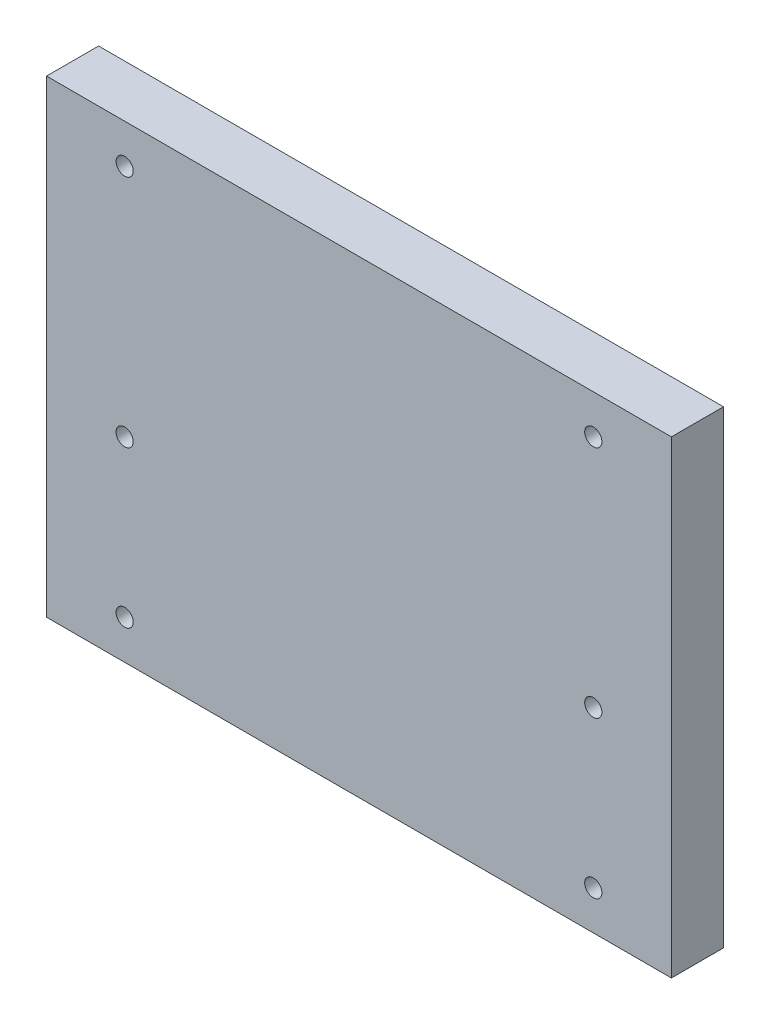
ISO-10303-21;
HEADER;
FILE_DESCRIPTION(('STEP AP214'),'2;1');
FILE_NAME('part.step','',(''),(''),'','','');
FILE_SCHEMA(('AUTOMOTIVE_DESIGN { 1 0 10303 214 1 1 1 1 }'));
ENDSEC;
DATA;
#1=APPLICATION_CONTEXT('core data for automotive mechanical design processes');
#2=APPLICATION_PROTOCOL_DEFINITION('international standard','automotive_design',2000,#1);
#3=PRODUCT_CONTEXT('',#1,'mechanical');
#4=PRODUCT('Part','Part','',(#3));
#5=PRODUCT_RELATED_PRODUCT_CATEGORY('part','',(#4));
#6=PRODUCT_DEFINITION_FORMATION('','',#4);
#7=PRODUCT_DEFINITION_CONTEXT('part definition',#1,'design');
#8=PRODUCT_DEFINITION('design','',#6,#7);
#9=PRODUCT_DEFINITION_SHAPE('','',#8);
#10=(LENGTH_UNIT() NAMED_UNIT(*) SI_UNIT(.MILLI.,.METRE.));
#11=(NAMED_UNIT(*) PLANE_ANGLE_UNIT() SI_UNIT($,.RADIAN.));
#12=(NAMED_UNIT(*) SI_UNIT($,.STERADIAN.) SOLID_ANGLE_UNIT());
#13=UNCERTAINTY_MEASURE_WITH_UNIT(LENGTH_MEASURE(1.E-05),#10,'distance_accuracy_value','');
#14=(GEOMETRIC_REPRESENTATION_CONTEXT(3) GLOBAL_UNCERTAINTY_ASSIGNED_CONTEXT((#13)) GLOBAL_UNIT_ASSIGNED_CONTEXT((#10,
#11,#12)) REPRESENTATION_CONTEXT('',''));
#15=CARTESIAN_POINT('',(0.,0.,0.));
#16=DIRECTION('',(0.,0.,1.));
#17=DIRECTION('',(1.,0.,0.));
#18=AXIS2_PLACEMENT_3D('',#15,#16,#17);
#19=CARTESIAN_POINT('',(120.,90.,20.));
#20=DIRECTION('',(-1.,0.,0.));
#21=DIRECTION('',(0.,-1.,0.));
#22=AXIS2_PLACEMENT_3D('',#19,#20,#21);
#23=PLANE('',#22);
#24=DIRECTION('',(0.,1.,0.));
#25=VECTOR('',#24,1.);
#26=CARTESIAN_POINT('',(120.,90.,0.));
#27=LINE('',#26,#25);
#28=CARTESIAN_POINT('',(120.,-90.,0.));
#29=VERTEX_POINT('',#28);
#30=CARTESIAN_POINT('',(120.,90.,0.));
#31=VERTEX_POINT('',#30);
#32=EDGE_CURVE('E100',#29,#31,#27,.T.);
#33=ORIENTED_EDGE('',*,*,#32,.T.);
#34=DIRECTION('',(0.,0.,-1.));
#35=VECTOR('',#34,1.);
#36=CARTESIAN_POINT('',(120.,90.,20.));
#37=LINE('',#36,#35);
#38=CARTESIAN_POINT('',(120.,90.,20.));
#39=VERTEX_POINT('',#38);
#40=EDGE_CURVE('E11',#39,#31,#37,.T.);
#41=ORIENTED_EDGE('',*,*,#40,.F.);
#42=DIRECTION('',(0.,1.,0.));
#43=VECTOR('',#42,1.);
#44=CARTESIAN_POINT('',(120.,90.,20.));
#45=LINE('',#44,#43);
#46=CARTESIAN_POINT('',(120.,-90.,20.));
#47=VERTEX_POINT('',#46);
#48=EDGE_CURVE('E88',#47,#39,#45,.T.);
#49=ORIENTED_EDGE('',*,*,#48,.F.);
#50=DIRECTION('',(0.,0.,-1.));
#51=VECTOR('',#50,1.);
#52=CARTESIAN_POINT('',(120.,-90.,20.));
#53=LINE('',#52,#51);
#54=EDGE_CURVE('E96',#47,#29,#53,.T.);
#55=ORIENTED_EDGE('',*,*,#54,.T.);
#56=EDGE_LOOP('',(#33,#41,#49,#55));
#57=FACE_BOUND('',#56,.T.);
#58=ADVANCED_FACE('F37',(#57),#23,.F.);
#59=CARTESIAN_POINT('',(-120.,90.,20.));
#60=DIRECTION('',(0.,-1.,0.));
#61=DIRECTION('',(1.,0.,0.));
#62=AXIS2_PLACEMENT_3D('',#59,#60,#61);
#63=PLANE('',#62);
#64=DIRECTION('',(-1.,0.,0.));
#65=VECTOR('',#64,1.);
#66=CARTESIAN_POINT('',(-120.,90.,0.));
#67=LINE('',#66,#65);
#68=CARTESIAN_POINT('',(-120.,90.,0.));
#69=VERTEX_POINT('',#68);
#70=EDGE_CURVE('E92',#31,#69,#67,.T.);
#71=ORIENTED_EDGE('',*,*,#70,.T.);
#72=DIRECTION('',(0.,0.,-1.));
#73=VECTOR('',#72,1.);
#74=CARTESIAN_POINT('',(-120.,90.,20.));
#75=LINE('',#74,#73);
#76=CARTESIAN_POINT('',(-120.,90.,20.));
#77=VERTEX_POINT('',#76);
#78=EDGE_CURVE('E45',#77,#69,#75,.T.);
#79=ORIENTED_EDGE('',*,*,#78,.F.);
#80=DIRECTION('',(-1.,0.,0.));
#81=VECTOR('',#80,1.);
#82=CARTESIAN_POINT('',(-120.,90.,20.));
#83=LINE('',#82,#81);
#84=EDGE_CURVE('E83',#39,#77,#83,.T.);
#85=ORIENTED_EDGE('',*,*,#84,.F.);
#86=ORIENTED_EDGE('',*,*,#40,.T.);
#87=EDGE_LOOP('',(#71,#79,#85,#86));
#88=FACE_BOUND('',#87,.T.);
#89=ADVANCED_FACE('F91',(#88),#63,.F.);
#90=CARTESIAN_POINT('',(-120.,90.,20.));
#91=DIRECTION('',(1.,0.,0.));
#92=DIRECTION('',(0.,1.,0.));
#93=AXIS2_PLACEMENT_3D('',#90,#91,#92);
#94=PLANE('',#93);
#95=DIRECTION('',(0.,-1.,0.));
#96=VECTOR('',#95,1.);
#97=CARTESIAN_POINT('',(-120.,90.,0.));
#98=LINE('',#97,#96);
#99=CARTESIAN_POINT('',(-120.,-90.,0.));
#100=VERTEX_POINT('',#99);
#101=EDGE_CURVE('E70',#69,#100,#98,.T.);
#102=ORIENTED_EDGE('',*,*,#101,.T.);
#103=DIRECTION('',(0.,0.,-1.));
#104=VECTOR('',#103,1.);
#105=CARTESIAN_POINT('',(-120.,-90.,20.));
#106=LINE('',#105,#104);
#107=CARTESIAN_POINT('',(-120.,-90.,20.));
#108=VERTEX_POINT('',#107);
#109=EDGE_CURVE('E93',#108,#100,#106,.T.);
#110=ORIENTED_EDGE('',*,*,#109,.F.);
#111=DIRECTION('',(0.,-1.,0.));
#112=VECTOR('',#111,1.);
#113=CARTESIAN_POINT('',(-120.,90.,20.));
#114=LINE('',#113,#112);
#115=EDGE_CURVE('E86',#77,#108,#114,.T.);
#116=ORIENTED_EDGE('',*,*,#115,.F.);
#117=ORIENTED_EDGE('',*,*,#78,.T.);
#118=EDGE_LOOP('',(#102,#110,#116,#117));
#119=FACE_BOUND('',#118,.T.);
#120=ADVANCED_FACE('F94',(#119),#94,.F.);
#121=CARTESIAN_POINT('',(-120.,-90.,20.));
#122=DIRECTION('',(0.,1.,0.));
#123=DIRECTION('',(-1.,0.,0.));
#124=AXIS2_PLACEMENT_3D('',#121,#122,#123);
#125=PLANE('',#124);
#126=DIRECTION('',(1.,0.,0.));
#127=VECTOR('',#126,1.);
#128=CARTESIAN_POINT('',(-120.,-90.,0.));
#129=LINE('',#128,#127);
#130=EDGE_CURVE('E76',#100,#29,#129,.T.);
#131=ORIENTED_EDGE('',*,*,#130,.T.);
#132=ORIENTED_EDGE('',*,*,#54,.F.);
#133=DIRECTION('',(1.,0.,0.));
#134=VECTOR('',#133,1.);
#135=CARTESIAN_POINT('',(-120.,-90.,20.));
#136=LINE('',#135,#134);
#137=EDGE_CURVE('E53',#108,#47,#136,.T.);
#138=ORIENTED_EDGE('',*,*,#137,.F.);
#139=ORIENTED_EDGE('',*,*,#109,.T.);
#140=EDGE_LOOP('',(#131,#132,#138,#139));
#141=FACE_BOUND('',#140,.T.);
#142=ADVANCED_FACE('F108',(#141),#125,.F.);
#143=CARTESIAN_POINT('',(0.,0.,20.));
#144=DIRECTION('',(0.,0.,1.));
#145=DIRECTION('',(1.,0.,0.));
#146=AXIS2_PLACEMENT_3D('',#143,#144,#145);
#147=PLANE('',#146);
#148=CARTESIAN_POINT('',(90.,75.,20.));
#149=DIRECTION('',(0.,0.,-1.));
#150=DIRECTION('',(-1.,0.,0.));
#151=AXIS2_PLACEMENT_3D('',#148,#149,#150);
#152=CIRCLE('',#151,3.3);
#153=CARTESIAN_POINT('',(86.7,75.,20.));
#154=VERTEX_POINT('',#153);
#155=EDGE_CURVE('E173',#154,#154,#152,.T.);
#156=ORIENTED_EDGE('',*,*,#155,.T.);
#157=EDGE_LOOP('',(#156));
#158=FACE_BOUND('',#157,.T.);
#159=CARTESIAN_POINT('',(90.,-75.,20.));
#160=DIRECTION('',(0.,0.,-1.));
#161=DIRECTION('',(-1.,0.,0.));
#162=AXIS2_PLACEMENT_3D('',#159,#160,#161);
#163=CIRCLE('',#162,3.3);
#164=CARTESIAN_POINT('',(86.7,-75.,20.));
#165=VERTEX_POINT('',#164);
#166=EDGE_CURVE('E161',#165,#165,#163,.T.);
#167=ORIENTED_EDGE('',*,*,#166,.T.);
#168=EDGE_LOOP('',(#167));
#169=FACE_BOUND('',#168,.T.);
#170=CARTESIAN_POINT('',(90.,-15.,20.));
#171=DIRECTION('',(0.,0.,-1.));
#172=DIRECTION('',(-1.,0.,0.));
#173=AXIS2_PLACEMENT_3D('',#170,#171,#172);
#174=CIRCLE('',#173,3.3);
#175=CARTESIAN_POINT('',(86.7,-15.,20.));
#176=VERTEX_POINT('',#175);
#177=EDGE_CURVE('E149',#176,#176,#174,.T.);
#178=ORIENTED_EDGE('',*,*,#177,.T.);
#179=EDGE_LOOP('',(#178));
#180=FACE_BOUND('',#179,.T.);
#181=CARTESIAN_POINT('',(-90.,-15.,20.));
#182=DIRECTION('',(0.,0.,-1.));
#183=DIRECTION('',(-1.,0.,0.));
#184=AXIS2_PLACEMENT_3D('',#181,#182,#183);
#185=CIRCLE('',#184,3.3);
#186=CARTESIAN_POINT('',(-93.3,-15.,20.));
#187=VERTEX_POINT('',#186);
#188=EDGE_CURVE('E137',#187,#187,#185,.T.);
#189=ORIENTED_EDGE('',*,*,#188,.T.);
#190=EDGE_LOOP('',(#189));
#191=FACE_BOUND('',#190,.T.);
#192=CARTESIAN_POINT('',(-90.,-75.,20.));
#193=DIRECTION('',(0.,0.,-1.));
#194=DIRECTION('',(-1.,0.,0.));
#195=AXIS2_PLACEMENT_3D('',#192,#193,#194);
#196=CIRCLE('',#195,3.3);
#197=CARTESIAN_POINT('',(-93.3,-75.,20.));
#198=VERTEX_POINT('',#197);
#199=EDGE_CURVE('E125',#198,#198,#196,.T.);
#200=ORIENTED_EDGE('',*,*,#199,.T.);
#201=EDGE_LOOP('',(#200));
#202=FACE_BOUND('',#201,.T.);
#203=CARTESIAN_POINT('',(-90.,75.,20.));
#204=DIRECTION('',(0.,0.,-1.));
#205=DIRECTION('',(-1.,0.,0.));
#206=AXIS2_PLACEMENT_3D('',#203,#204,#205);
#207=CIRCLE('',#206,3.3);
#208=CARTESIAN_POINT('',(-93.3,75.,20.));
#209=VERTEX_POINT('',#208);
#210=EDGE_CURVE('E103',#209,#209,#207,.T.);
#211=ORIENTED_EDGE('',*,*,#210,.T.);
#212=EDGE_LOOP('',(#211));
#213=FACE_BOUND('',#212,.T.);
#214=ORIENTED_EDGE('',*,*,#48,.T.);
#215=ORIENTED_EDGE('',*,*,#84,.T.);
#216=ORIENTED_EDGE('',*,*,#115,.T.);
#217=ORIENTED_EDGE('',*,*,#137,.T.);
#218=EDGE_LOOP('',(#214,#215,#216,#217));
#219=FACE_BOUND('',#218,.T.);
#220=ADVANCED_FACE('F84',(#158,#169,#180,#191,#202,#213,#219),#147,.T.);
#221=CARTESIAN_POINT('',(0.,0.,0.));
#222=DIRECTION('',(0.,0.,1.));
#223=DIRECTION('',(1.,0.,0.));
#224=AXIS2_PLACEMENT_3D('',#221,#222,#223);
#225=PLANE('',#224);
#226=CARTESIAN_POINT('',(90.,75.,0.));
#227=DIRECTION('',(0.,0.,-1.));
#228=DIRECTION('',(-1.,0.,0.));
#229=AXIS2_PLACEMENT_3D('',#226,#227,#228);
#230=CIRCLE('',#229,5.50000000000001);
#231=CARTESIAN_POINT('',(84.5,75.,0.));
#232=VERTEX_POINT('',#231);
#233=EDGE_CURVE('E182',#232,#232,#230,.T.);
#234=ORIENTED_EDGE('',*,*,#233,.F.);
#235=EDGE_LOOP('',(#234));
#236=FACE_BOUND('',#235,.T.);
#237=CARTESIAN_POINT('',(90.,-75.,0.));
#238=DIRECTION('',(0.,0.,-1.));
#239=DIRECTION('',(-1.,0.,0.));
#240=AXIS2_PLACEMENT_3D('',#237,#238,#239);
#241=CIRCLE('',#240,5.50000000000001);
#242=CARTESIAN_POINT('',(84.5,-75.,0.));
#243=VERTEX_POINT('',#242);
#244=EDGE_CURVE('E170',#243,#243,#241,.T.);
#245=ORIENTED_EDGE('',*,*,#244,.F.);
#246=EDGE_LOOP('',(#245));
#247=FACE_BOUND('',#246,.T.);
#248=CARTESIAN_POINT('',(90.,-15.,0.));
#249=DIRECTION('',(0.,0.,-1.));
#250=DIRECTION('',(-1.,0.,0.));
#251=AXIS2_PLACEMENT_3D('',#248,#249,#250);
#252=CIRCLE('',#251,5.50000000000001);
#253=CARTESIAN_POINT('',(84.5,-15.,0.));
#254=VERTEX_POINT('',#253);
#255=EDGE_CURVE('E158',#254,#254,#252,.T.);
#256=ORIENTED_EDGE('',*,*,#255,.F.);
#257=EDGE_LOOP('',(#256));
#258=FACE_BOUND('',#257,.T.);
#259=CARTESIAN_POINT('',(-90.,-15.,0.));
#260=DIRECTION('',(0.,0.,-1.));
#261=DIRECTION('',(-1.,0.,0.));
#262=AXIS2_PLACEMENT_3D('',#259,#260,#261);
#263=CIRCLE('',#262,5.50000000000001);
#264=CARTESIAN_POINT('',(-95.5,-15.,0.));
#265=VERTEX_POINT('',#264);
#266=EDGE_CURVE('E146',#265,#265,#263,.T.);
#267=ORIENTED_EDGE('',*,*,#266,.F.);
#268=EDGE_LOOP('',(#267));
#269=FACE_BOUND('',#268,.T.);
#270=CARTESIAN_POINT('',(-90.,-75.,0.));
#271=DIRECTION('',(0.,0.,-1.));
#272=DIRECTION('',(-1.,0.,0.));
#273=AXIS2_PLACEMENT_3D('',#270,#271,#272);
#274=CIRCLE('',#273,5.50000000000001);
#275=CARTESIAN_POINT('',(-95.5,-75.,0.));
#276=VERTEX_POINT('',#275);
#277=EDGE_CURVE('E134',#276,#276,#274,.T.);
#278=ORIENTED_EDGE('',*,*,#277,.F.);
#279=EDGE_LOOP('',(#278));
#280=FACE_BOUND('',#279,.T.);
#281=CARTESIAN_POINT('',(-90.,75.,0.));
#282=DIRECTION('',(0.,0.,-1.));
#283=DIRECTION('',(-1.,0.,0.));
#284=AXIS2_PLACEMENT_3D('',#281,#282,#283);
#285=CIRCLE('',#284,5.50000000000001);
#286=CARTESIAN_POINT('',(-95.5,75.,0.));
#287=VERTEX_POINT('',#286);
#288=EDGE_CURVE('E122',#287,#287,#285,.T.);
#289=ORIENTED_EDGE('',*,*,#288,.F.);
#290=EDGE_LOOP('',(#289));
#291=FACE_BOUND('',#290,.T.);
#292=ORIENTED_EDGE('',*,*,#32,.F.);
#293=ORIENTED_EDGE('',*,*,#130,.F.);
#294=ORIENTED_EDGE('',*,*,#101,.F.);
#295=ORIENTED_EDGE('',*,*,#70,.F.);
#296=EDGE_LOOP('',(#292,#293,#294,#295));
#297=FACE_BOUND('',#296,.T.);
#298=ADVANCED_FACE('F111',(#236,#247,#258,#269,#280,#291,#297),#225,.F.);
#299=CARTESIAN_POINT('',(-90.,75.,0.));
#300=DIRECTION('',(0.,0.,-1.));
#301=DIRECTION('',(-1.,0.,0.));
#302=AXIS2_PLACEMENT_3D('',#299,#300,#301);
#303=CYLINDRICAL_SURFACE('',#302,3.3);
#304=ORIENTED_EDGE('',*,*,#210,.F.);
#305=EDGE_LOOP('',(#304));
#306=FACE_BOUND('',#305,.T.);
#307=CARTESIAN_POINT('',(-90.,75.,6.4));
#308=DIRECTION('',(0.,0.,-1.));
#309=DIRECTION('',(-1.,0.,0.));
#310=AXIS2_PLACEMENT_3D('',#307,#308,#309);
#311=CIRCLE('',#310,3.3);
#312=CARTESIAN_POINT('',(-93.3,75.,6.4));
#313=VERTEX_POINT('',#312);
#314=EDGE_CURVE('E116',#313,#313,#311,.T.);
#315=ORIENTED_EDGE('',*,*,#314,.T.);
#316=EDGE_LOOP('',(#315));
#317=FACE_BOUND('',#316,.T.);
#318=ADVANCED_FACE('F190',(#306,#317),#303,.F.);
#319=CARTESIAN_POINT('',(-86.7,75.,6.4));
#320=DIRECTION('',(0.,0.,1.));
#321=DIRECTION('',(1.,0.,0.));
#322=AXIS2_PLACEMENT_3D('',#319,#320,#321);
#323=PLANE('',#322);
#324=ORIENTED_EDGE('',*,*,#314,.F.);
#325=EDGE_LOOP('',(#324));
#326=FACE_BOUND('',#325,.T.);
#327=CARTESIAN_POINT('',(-90.,75.,6.4));
#328=DIRECTION('',(0.,0.,-1.));
#329=DIRECTION('',(-1.,0.,0.));
#330=AXIS2_PLACEMENT_3D('',#327,#328,#329);
#331=CIRCLE('',#330,5.50000000000001);
#332=CARTESIAN_POINT('',(-95.5,75.,6.4));
#333=VERTEX_POINT('',#332);
#334=EDGE_CURVE('E119',#333,#333,#331,.T.);
#335=ORIENTED_EDGE('',*,*,#334,.T.);
#336=EDGE_LOOP('',(#335));
#337=FACE_BOUND('',#336,.T.);
#338=ADVANCED_FACE('F205',(#326,#337),#323,.F.);
#339=CARTESIAN_POINT('',(-90.,75.,0.));
#340=DIRECTION('',(0.,0.,-1.));
#341=DIRECTION('',(-1.,0.,0.));
#342=AXIS2_PLACEMENT_3D('',#339,#340,#341);
#343=CYLINDRICAL_SURFACE('',#342,5.50000000000001);
#344=ORIENTED_EDGE('',*,*,#334,.F.);
#345=EDGE_LOOP('',(#344));
#346=FACE_BOUND('',#345,.T.);
#347=ORIENTED_EDGE('',*,*,#288,.T.);
#348=EDGE_LOOP('',(#347));
#349=FACE_BOUND('',#348,.T.);
#350=ADVANCED_FACE('F202',(#346,#349),#343,.F.);
#351=CARTESIAN_POINT('',(-90.,-75.,0.));
#352=DIRECTION('',(0.,0.,-1.));
#353=DIRECTION('',(-1.,0.,0.));
#354=AXIS2_PLACEMENT_3D('',#351,#352,#353);
#355=CYLINDRICAL_SURFACE('',#354,3.3);
#356=ORIENTED_EDGE('',*,*,#199,.F.);
#357=EDGE_LOOP('',(#356));
#358=FACE_BOUND('',#357,.T.);
#359=CARTESIAN_POINT('',(-90.,-75.,6.4));
#360=DIRECTION('',(0.,0.,-1.));
#361=DIRECTION('',(-1.,0.,0.));
#362=AXIS2_PLACEMENT_3D('',#359,#360,#361);
#363=CIRCLE('',#362,3.3);
#364=CARTESIAN_POINT('',(-93.3,-75.,6.4));
#365=VERTEX_POINT('',#364);
#366=EDGE_CURVE('E128',#365,#365,#363,.T.);
#367=ORIENTED_EDGE('',*,*,#366,.T.);
#368=EDGE_LOOP('',(#367));
#369=FACE_BOUND('',#368,.T.);
#370=ADVANCED_FACE('F204',(#358,#369),#355,.F.);
#371=CARTESIAN_POINT('',(-86.7,-75.,6.4));
#372=DIRECTION('',(0.,0.,1.));
#373=DIRECTION('',(1.,0.,0.));
#374=AXIS2_PLACEMENT_3D('',#371,#372,#373);
#375=PLANE('',#374);
#376=ORIENTED_EDGE('',*,*,#366,.F.);
#377=EDGE_LOOP('',(#376));
#378=FACE_BOUND('',#377,.T.);
#379=CARTESIAN_POINT('',(-90.,-75.,6.4));
#380=DIRECTION('',(0.,0.,-1.));
#381=DIRECTION('',(-1.,0.,0.));
#382=AXIS2_PLACEMENT_3D('',#379,#380,#381);
#383=CIRCLE('',#382,5.49999999999999);
#384=CARTESIAN_POINT('',(-95.5,-75.,6.4));
#385=VERTEX_POINT('',#384);
#386=EDGE_CURVE('E131',#385,#385,#383,.T.);
#387=ORIENTED_EDGE('',*,*,#386,.T.);
#388=EDGE_LOOP('',(#387));
#389=FACE_BOUND('',#388,.T.);
#390=ADVANCED_FACE('F212',(#378,#389),#375,.F.);
#391=CARTESIAN_POINT('',(-90.,-75.,0.));
#392=DIRECTION('',(0.,0.,-1.));
#393=DIRECTION('',(-1.,0.,0.));
#394=AXIS2_PLACEMENT_3D('',#391,#392,#393);
#395=CYLINDRICAL_SURFACE('',#394,5.5);
#396=ORIENTED_EDGE('',*,*,#386,.F.);
#397=EDGE_LOOP('',(#396));
#398=FACE_BOUND('',#397,.T.);
#399=ORIENTED_EDGE('',*,*,#277,.T.);
#400=EDGE_LOOP('',(#399));
#401=FACE_BOUND('',#400,.T.);
#402=ADVANCED_FACE('F266',(#398,#401),#395,.F.);
#403=CARTESIAN_POINT('',(-90.,-15.,0.));
#404=DIRECTION('',(0.,0.,-1.));
#405=DIRECTION('',(-1.,0.,0.));
#406=AXIS2_PLACEMENT_3D('',#403,#404,#405);
#407=CYLINDRICAL_SURFACE('',#406,3.3);
#408=ORIENTED_EDGE('',*,*,#188,.F.);
#409=EDGE_LOOP('',(#408));
#410=FACE_BOUND('',#409,.T.);
#411=CARTESIAN_POINT('',(-90.,-15.,6.4));
#412=DIRECTION('',(0.,0.,-1.));
#413=DIRECTION('',(-1.,0.,0.));
#414=AXIS2_PLACEMENT_3D('',#411,#412,#413);
#415=CIRCLE('',#414,3.3);
#416=CARTESIAN_POINT('',(-93.3,-15.,6.4));
#417=VERTEX_POINT('',#416);
#418=EDGE_CURVE('E140',#417,#417,#415,.T.);
#419=ORIENTED_EDGE('',*,*,#418,.T.);
#420=EDGE_LOOP('',(#419));
#421=FACE_BOUND('',#420,.T.);
#422=ADVANCED_FACE('F276',(#410,#421),#407,.F.);
#423=CARTESIAN_POINT('',(-86.7,-15.,6.4));
#424=DIRECTION('',(0.,0.,1.));
#425=DIRECTION('',(1.,0.,0.));
#426=AXIS2_PLACEMENT_3D('',#423,#424,#425);
#427=PLANE('',#426);
#428=ORIENTED_EDGE('',*,*,#418,.F.);
#429=EDGE_LOOP('',(#428));
#430=FACE_BOUND('',#429,.T.);
#431=CARTESIAN_POINT('',(-90.,-15.,6.4));
#432=DIRECTION('',(0.,0.,-1.));
#433=DIRECTION('',(-1.,0.,0.));
#434=AXIS2_PLACEMENT_3D('',#431,#432,#433);
#435=CIRCLE('',#434,5.50000000000001);
#436=CARTESIAN_POINT('',(-95.5,-15.,6.4));
#437=VERTEX_POINT('',#436);
#438=EDGE_CURVE('E143',#437,#437,#435,.T.);
#439=ORIENTED_EDGE('',*,*,#438,.T.);
#440=EDGE_LOOP('',(#439));
#441=FACE_BOUND('',#440,.T.);
#442=ADVANCED_FACE('F286',(#430,#441),#427,.F.);
#443=CARTESIAN_POINT('',(-90.,-15.,0.));
#444=DIRECTION('',(0.,0.,-1.));
#445=DIRECTION('',(-1.,0.,0.));
#446=AXIS2_PLACEMENT_3D('',#443,#444,#445);
#447=CYLINDRICAL_SURFACE('',#446,5.50000000000001);
#448=ORIENTED_EDGE('',*,*,#438,.F.);
#449=EDGE_LOOP('',(#448));
#450=FACE_BOUND('',#449,.T.);
#451=ORIENTED_EDGE('',*,*,#266,.T.);
#452=EDGE_LOOP('',(#451));
#453=FACE_BOUND('',#452,.T.);
#454=ADVANCED_FACE('F296',(#450,#453),#447,.F.);
#455=CARTESIAN_POINT('',(90.,-15.,0.));
#456=DIRECTION('',(0.,0.,-1.));
#457=DIRECTION('',(-1.,0.,0.));
#458=AXIS2_PLACEMENT_3D('',#455,#456,#457);
#459=CYLINDRICAL_SURFACE('',#458,3.3);
#460=ORIENTED_EDGE('',*,*,#177,.F.);
#461=EDGE_LOOP('',(#460));
#462=FACE_BOUND('',#461,.T.);
#463=CARTESIAN_POINT('',(90.,-15.,6.4));
#464=DIRECTION('',(0.,0.,-1.));
#465=DIRECTION('',(-1.,0.,0.));
#466=AXIS2_PLACEMENT_3D('',#463,#464,#465);
#467=CIRCLE('',#466,3.3);
#468=CARTESIAN_POINT('',(86.7,-15.,6.4));
#469=VERTEX_POINT('',#468);
#470=EDGE_CURVE('E152',#469,#469,#467,.T.);
#471=ORIENTED_EDGE('',*,*,#470,.T.);
#472=EDGE_LOOP('',(#471));
#473=FACE_BOUND('',#472,.T.);
#474=ADVANCED_FACE('F306',(#462,#473),#459,.F.);
#475=CARTESIAN_POINT('',(93.3,-15.,6.4));
#476=DIRECTION('',(0.,0.,1.));
#477=DIRECTION('',(1.,0.,0.));
#478=AXIS2_PLACEMENT_3D('',#475,#476,#477);
#479=PLANE('',#478);
#480=ORIENTED_EDGE('',*,*,#470,.F.);
#481=EDGE_LOOP('',(#480));
#482=FACE_BOUND('',#481,.T.);
#483=CARTESIAN_POINT('',(90.,-15.,6.4));
#484=DIRECTION('',(0.,0.,-1.));
#485=DIRECTION('',(-1.,0.,0.));
#486=AXIS2_PLACEMENT_3D('',#483,#484,#485);
#487=CIRCLE('',#486,5.50000000000001);
#488=CARTESIAN_POINT('',(84.5,-15.,6.4));
#489=VERTEX_POINT('',#488);
#490=EDGE_CURVE('E155',#489,#489,#487,.T.);
#491=ORIENTED_EDGE('',*,*,#490,.T.);
#492=EDGE_LOOP('',(#491));
#493=FACE_BOUND('',#492,.T.);
#494=ADVANCED_FACE('F316',(#482,#493),#479,.F.);
#495=CARTESIAN_POINT('',(90.,-15.,0.));
#496=DIRECTION('',(0.,0.,-1.));
#497=DIRECTION('',(-1.,0.,0.));
#498=AXIS2_PLACEMENT_3D('',#495,#496,#497);
#499=CYLINDRICAL_SURFACE('',#498,5.50000000000001);
#500=ORIENTED_EDGE('',*,*,#490,.F.);
#501=EDGE_LOOP('',(#500));
#502=FACE_BOUND('',#501,.T.);
#503=ORIENTED_EDGE('',*,*,#255,.T.);
#504=EDGE_LOOP('',(#503));
#505=FACE_BOUND('',#504,.T.);
#506=ADVANCED_FACE('F326',(#502,#505),#499,.F.);
#507=CARTESIAN_POINT('',(90.,-75.,0.));
#508=DIRECTION('',(0.,0.,-1.));
#509=DIRECTION('',(-1.,0.,0.));
#510=AXIS2_PLACEMENT_3D('',#507,#508,#509);
#511=CYLINDRICAL_SURFACE('',#510,3.3);
#512=ORIENTED_EDGE('',*,*,#166,.F.);
#513=EDGE_LOOP('',(#512));
#514=FACE_BOUND('',#513,.T.);
#515=CARTESIAN_POINT('',(90.,-75.,6.4));
#516=DIRECTION('',(0.,0.,-1.));
#517=DIRECTION('',(-1.,0.,0.));
#518=AXIS2_PLACEMENT_3D('',#515,#516,#517);
#519=CIRCLE('',#518,3.3);
#520=CARTESIAN_POINT('',(86.7,-75.,6.4));
#521=VERTEX_POINT('',#520);
#522=EDGE_CURVE('E164',#521,#521,#519,.T.);
#523=ORIENTED_EDGE('',*,*,#522,.T.);
#524=EDGE_LOOP('',(#523));
#525=FACE_BOUND('',#524,.T.);
#526=ADVANCED_FACE('F336',(#514,#525),#511,.F.);
#527=CARTESIAN_POINT('',(93.3,-75.,6.4));
#528=DIRECTION('',(0.,0.,1.));
#529=DIRECTION('',(1.,0.,0.));
#530=AXIS2_PLACEMENT_3D('',#527,#528,#529);
#531=PLANE('',#530);
#532=ORIENTED_EDGE('',*,*,#522,.F.);
#533=EDGE_LOOP('',(#532));
#534=FACE_BOUND('',#533,.T.);
#535=CARTESIAN_POINT('',(90.,-75.,6.4));
#536=DIRECTION('',(0.,0.,-1.));
#537=DIRECTION('',(-1.,0.,0.));
#538=AXIS2_PLACEMENT_3D('',#535,#536,#537);
#539=CIRCLE('',#538,5.49999999999999);
#540=CARTESIAN_POINT('',(84.5,-75.,6.4));
#541=VERTEX_POINT('',#540);
#542=EDGE_CURVE('E167',#541,#541,#539,.T.);
#543=ORIENTED_EDGE('',*,*,#542,.T.);
#544=EDGE_LOOP('',(#543));
#545=FACE_BOUND('',#544,.T.);
#546=ADVANCED_FACE('F346',(#534,#545),#531,.F.);
#547=CARTESIAN_POINT('',(90.,-75.,0.));
#548=DIRECTION('',(0.,0.,-1.));
#549=DIRECTION('',(-1.,0.,0.));
#550=AXIS2_PLACEMENT_3D('',#547,#548,#549);
#551=CYLINDRICAL_SURFACE('',#550,5.5);
#552=ORIENTED_EDGE('',*,*,#542,.F.);
#553=EDGE_LOOP('',(#552));
#554=FACE_BOUND('',#553,.T.);
#555=ORIENTED_EDGE('',*,*,#244,.T.);
#556=EDGE_LOOP('',(#555));
#557=FACE_BOUND('',#556,.T.);
#558=ADVANCED_FACE('F356',(#554,#557),#551,.F.);
#559=CARTESIAN_POINT('',(90.,75.,0.));
#560=DIRECTION('',(0.,0.,-1.));
#561=DIRECTION('',(-1.,0.,0.));
#562=AXIS2_PLACEMENT_3D('',#559,#560,#561);
#563=CYLINDRICAL_SURFACE('',#562,3.3);
#564=ORIENTED_EDGE('',*,*,#155,.F.);
#565=EDGE_LOOP('',(#564));
#566=FACE_BOUND('',#565,.T.);
#567=CARTESIAN_POINT('',(90.,75.,6.4));
#568=DIRECTION('',(0.,0.,-1.));
#569=DIRECTION('',(-1.,0.,0.));
#570=AXIS2_PLACEMENT_3D('',#567,#568,#569);
#571=CIRCLE('',#570,3.3);
#572=CARTESIAN_POINT('',(86.7,75.,6.4));
#573=VERTEX_POINT('',#572);
#574=EDGE_CURVE('E176',#573,#573,#571,.T.);
#575=ORIENTED_EDGE('',*,*,#574,.T.);
#576=EDGE_LOOP('',(#575));
#577=FACE_BOUND('',#576,.T.);
#578=ADVANCED_FACE('F366',(#566,#577),#563,.F.);
#579=CARTESIAN_POINT('',(93.3,75.,6.4));
#580=DIRECTION('',(0.,0.,1.));
#581=DIRECTION('',(1.,0.,0.));
#582=AXIS2_PLACEMENT_3D('',#579,#580,#581);
#583=PLANE('',#582);
#584=ORIENTED_EDGE('',*,*,#574,.F.);
#585=EDGE_LOOP('',(#584));
#586=FACE_BOUND('',#585,.T.);
#587=CARTESIAN_POINT('',(90.,75.,6.4));
#588=DIRECTION('',(0.,0.,-1.));
#589=DIRECTION('',(-1.,0.,0.));
#590=AXIS2_PLACEMENT_3D('',#587,#588,#589);
#591=CIRCLE('',#590,5.50000000000001);
#592=CARTESIAN_POINT('',(84.5,75.,6.4));
#593=VERTEX_POINT('',#592);
#594=EDGE_CURVE('E179',#593,#593,#591,.T.);
#595=ORIENTED_EDGE('',*,*,#594,.T.);
#596=EDGE_LOOP('',(#595));
#597=FACE_BOUND('',#596,.T.);
#598=ADVANCED_FACE('F376',(#586,#597),#583,.F.);
#599=CARTESIAN_POINT('',(90.,75.,0.));
#600=DIRECTION('',(0.,0.,-1.));
#601=DIRECTION('',(-1.,0.,0.));
#602=AXIS2_PLACEMENT_3D('',#599,#600,#601);
#603=CYLINDRICAL_SURFACE('',#602,5.50000000000001);
#604=ORIENTED_EDGE('',*,*,#594,.F.);
#605=EDGE_LOOP('',(#604));
#606=FACE_BOUND('',#605,.T.);
#607=ORIENTED_EDGE('',*,*,#233,.T.);
#608=EDGE_LOOP('',(#607));
#609=FACE_BOUND('',#608,.T.);
#610=ADVANCED_FACE('F186',(#606,#609),#603,.F.);
#611=CLOSED_SHELL('',(#58,#89,#120,#142,#220,#298,#318,#338,#350,#370,#390,#402,#422,#442,#454,
#474,#494,#506,#526,#546,#558,#578,#598,#610));
#612=MANIFOLD_SOLID_BREP('B2',#611);
#613=ADVANCED_BREP_SHAPE_REPRESENTATION('',(#18,#612),#14);
#614=SHAPE_DEFINITION_REPRESENTATION(#9,#613);
ENDSEC;
END-ISO-10303-21;
